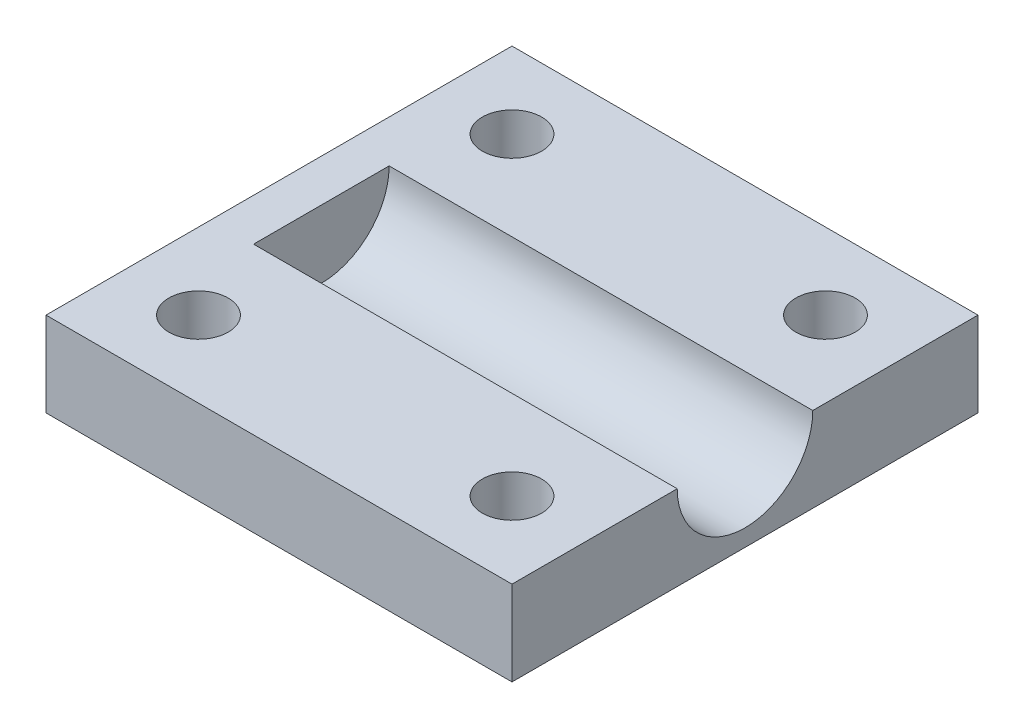
ISO-10303-21;
HEADER;
FILE_DESCRIPTION(('STEP AP214'),'2;1');
FILE_NAME('part.step','',(''),(''),'','','');
FILE_SCHEMA(('AUTOMOTIVE_DESIGN { 1 0 10303 214 1 1 1 1 }'));
ENDSEC;
DATA;
#1=APPLICATION_CONTEXT('core data for automotive mechanical design processes');
#2=APPLICATION_PROTOCOL_DEFINITION('international standard','automotive_design',2000,#1);
#3=PRODUCT_CONTEXT('',#1,'mechanical');
#4=PRODUCT('Part','Part','',(#3));
#5=PRODUCT_RELATED_PRODUCT_CATEGORY('part','',(#4));
#6=PRODUCT_DEFINITION_FORMATION('','',#4);
#7=PRODUCT_DEFINITION_CONTEXT('part definition',#1,'design');
#8=PRODUCT_DEFINITION('design','',#6,#7);
#9=PRODUCT_DEFINITION_SHAPE('','',#8);
#10=(LENGTH_UNIT() NAMED_UNIT(*) SI_UNIT(.MILLI.,.METRE.));
#11=(NAMED_UNIT(*) PLANE_ANGLE_UNIT() SI_UNIT($,.RADIAN.));
#12=(NAMED_UNIT(*) SI_UNIT($,.STERADIAN.) SOLID_ANGLE_UNIT());
#13=UNCERTAINTY_MEASURE_WITH_UNIT(LENGTH_MEASURE(1.E-05),#10,'distance_accuracy_value','');
#14=(GEOMETRIC_REPRESENTATION_CONTEXT(3) GLOBAL_UNCERTAINTY_ASSIGNED_CONTEXT((#13)) GLOBAL_UNIT_ASSIGNED_CONTEXT((#10,
#11,#12)) REPRESENTATION_CONTEXT('',''));
#15=CARTESIAN_POINT('',(0.,0.,0.));
#16=DIRECTION('',(0.,0.,1.));
#17=DIRECTION('',(1.,0.,0.));
#18=AXIS2_PLACEMENT_3D('',#15,#16,#17);
#19=CARTESIAN_POINT('',(27.5,10.,-27.5));
#20=DIRECTION('',(-1.,0.,0.));
#21=DIRECTION('',(0.,0.,1.));
#22=AXIS2_PLACEMENT_3D('',#19,#20,#21);
#23=PLANE('',#22);
#24=DIRECTION('',(0.,0.,-1.));
#25=VECTOR('',#24,1.);
#26=CARTESIAN_POINT('',(27.5,10.,-27.5));
#27=LINE('',#26,#25);
#28=CARTESIAN_POINT('',(27.5,10.,-8.));
#29=VERTEX_POINT('',#28);
#30=CARTESIAN_POINT('',(27.5,10.,-27.5));
#31=VERTEX_POINT('',#30);
#32=EDGE_CURVE('E97',#29,#31,#27,.T.);
#33=ORIENTED_EDGE('',*,*,#32,.F.);
#34=CARTESIAN_POINT('',(27.5,10.,0.));
#35=DIRECTION('',(1.,0.,0.));
#36=DIRECTION('',(0.,0.,-1.));
#37=AXIS2_PLACEMENT_3D('',#34,#35,#36);
#38=CIRCLE('',#37,8.);
#39=CARTESIAN_POINT('',(27.5,10.,8.));
#40=VERTEX_POINT('',#39);
#41=EDGE_CURVE('E107',#40,#29,#38,.T.);
#42=ORIENTED_EDGE('',*,*,#41,.F.);
#43=CARTESIAN_POINT('',(27.5,10.,27.5));
#44=VERTEX_POINT('',#43);
#45=EDGE_CURVE('E121',#44,#40,#27,.T.);
#46=ORIENTED_EDGE('',*,*,#45,.F.);
#47=DIRECTION('',(0.,-1.,0.));
#48=VECTOR('',#47,1.);
#49=CARTESIAN_POINT('',(27.5,10.,27.5));
#50=LINE('',#49,#48);
#51=CARTESIAN_POINT('',(27.5,0.,27.5));
#52=VERTEX_POINT('',#51);
#53=EDGE_CURVE('E132',#44,#52,#50,.T.);
#54=ORIENTED_EDGE('',*,*,#53,.T.);
#55=DIRECTION('',(0.,0.,-1.));
#56=VECTOR('',#55,1.);
#57=CARTESIAN_POINT('',(27.5,0.,-27.5));
#58=LINE('',#57,#56);
#59=CARTESIAN_POINT('',(27.5,0.,-27.5));
#60=VERTEX_POINT('',#59);
#61=EDGE_CURVE('E133',#52,#60,#58,.T.);
#62=ORIENTED_EDGE('',*,*,#61,.T.);
#63=DIRECTION('',(0.,-1.,0.));
#64=VECTOR('',#63,1.);
#65=CARTESIAN_POINT('',(27.5,10.,-27.5));
#66=LINE('',#65,#64);
#67=EDGE_CURVE('E120',#31,#60,#66,.T.);
#68=ORIENTED_EDGE('',*,*,#67,.F.);
#69=EDGE_LOOP('',(#33,#42,#46,#54,#62,#68));
#70=FACE_BOUND('',#69,.T.);
#71=ADVANCED_FACE('F47',(#70),#23,.F.);
#72=CARTESIAN_POINT('',(-27.5,10.,-27.5));
#73=DIRECTION('',(0.,0.,1.));
#74=DIRECTION('',(1.,0.,0.));
#75=AXIS2_PLACEMENT_3D('',#72,#73,#74);
#76=PLANE('',#75);
#77=DIRECTION('',(-1.,0.,0.));
#78=VECTOR('',#77,1.);
#79=CARTESIAN_POINT('',(-27.5,0.,-27.5));
#80=LINE('',#79,#78);
#81=CARTESIAN_POINT('',(-27.5,0.,-27.5));
#82=VERTEX_POINT('',#81);
#83=EDGE_CURVE('E135',#60,#82,#80,.T.);
#84=ORIENTED_EDGE('',*,*,#83,.T.);
#85=DIRECTION('',(0.,-1.,0.));
#86=VECTOR('',#85,1.);
#87=CARTESIAN_POINT('',(-27.5,10.,-27.5));
#88=LINE('',#87,#86);
#89=CARTESIAN_POINT('',(-27.5,10.,-27.5));
#90=VERTEX_POINT('',#89);
#91=EDGE_CURVE('E141',#90,#82,#88,.T.);
#92=ORIENTED_EDGE('',*,*,#91,.F.);
#93=DIRECTION('',(-1.,0.,0.));
#94=VECTOR('',#93,1.);
#95=CARTESIAN_POINT('',(-27.5,10.,-27.5));
#96=LINE('',#95,#94);
#97=EDGE_CURVE('E123',#31,#90,#96,.T.);
#98=ORIENTED_EDGE('',*,*,#97,.F.);
#99=ORIENTED_EDGE('',*,*,#67,.T.);
#100=EDGE_LOOP('',(#84,#92,#98,#99));
#101=FACE_BOUND('',#100,.T.);
#102=ADVANCED_FACE('F146',(#101),#76,.F.);
#103=CARTESIAN_POINT('',(-27.5,10.,-27.5));
#104=DIRECTION('',(1.,0.,0.));
#105=DIRECTION('',(0.,0.,-1.));
#106=AXIS2_PLACEMENT_3D('',#103,#104,#105);
#107=PLANE('',#106);
#108=DIRECTION('',(0.,0.,1.));
#109=VECTOR('',#108,1.);
#110=CARTESIAN_POINT('',(-27.5,0.,-27.5));
#111=LINE('',#110,#109);
#112=CARTESIAN_POINT('',(-27.5,0.,27.5));
#113=VERTEX_POINT('',#112);
#114=EDGE_CURVE('E124',#82,#113,#111,.T.);
#115=ORIENTED_EDGE('',*,*,#114,.T.);
#116=DIRECTION('',(0.,-1.,0.));
#117=VECTOR('',#116,1.);
#118=CARTESIAN_POINT('',(-27.5,10.,27.5));
#119=LINE('',#118,#117);
#120=CARTESIAN_POINT('',(-27.5,10.,27.5));
#121=VERTEX_POINT('',#120);
#122=EDGE_CURVE('E139',#121,#113,#119,.T.);
#123=ORIENTED_EDGE('',*,*,#122,.F.);
#124=DIRECTION('',(0.,0.,1.));
#125=VECTOR('',#124,1.);
#126=CARTESIAN_POINT('',(-27.5,10.,-27.5));
#127=LINE('',#126,#125);
#128=EDGE_CURVE('E129',#90,#121,#127,.T.);
#129=ORIENTED_EDGE('',*,*,#128,.F.);
#130=ORIENTED_EDGE('',*,*,#91,.T.);
#131=EDGE_LOOP('',(#115,#123,#129,#130));
#132=FACE_BOUND('',#131,.T.);
#133=ADVANCED_FACE('F154',(#132),#107,.F.);
#134=CARTESIAN_POINT('',(-27.5,10.,27.5));
#135=DIRECTION('',(0.,0.,-1.));
#136=DIRECTION('',(-1.,0.,0.));
#137=AXIS2_PLACEMENT_3D('',#134,#135,#136);
#138=PLANE('',#137);
#139=DIRECTION('',(1.,0.,0.));
#140=VECTOR('',#139,1.);
#141=CARTESIAN_POINT('',(-27.5,0.,27.5));
#142=LINE('',#141,#140);
#143=EDGE_CURVE('E90',#113,#52,#142,.T.);
#144=ORIENTED_EDGE('',*,*,#143,.T.);
#145=ORIENTED_EDGE('',*,*,#53,.F.);
#146=DIRECTION('',(1.,0.,0.));
#147=VECTOR('',#146,1.);
#148=CARTESIAN_POINT('',(-27.5,10.,27.5));
#149=LINE('',#148,#147);
#150=EDGE_CURVE('E69',#121,#44,#149,.T.);
#151=ORIENTED_EDGE('',*,*,#150,.F.);
#152=ORIENTED_EDGE('',*,*,#122,.T.);
#153=EDGE_LOOP('',(#144,#145,#151,#152));
#154=FACE_BOUND('',#153,.T.);
#155=ADVANCED_FACE('F156',(#154),#138,.F.);
#156=CARTESIAN_POINT('',(0.,10.,0.));
#157=DIRECTION('',(0.,1.,0.));
#158=DIRECTION('',(0.,0.,1.));
#159=AXIS2_PLACEMENT_3D('',#156,#157,#158);
#160=PLANE('',#159);
#161=CARTESIAN_POINT('',(18.5,10.,-18.5));
#162=DIRECTION('',(0.,1.,0.));
#163=DIRECTION('',(0.,0.,1.));
#164=AXIS2_PLACEMENT_3D('',#161,#162,#163);
#165=CIRCLE('',#164,3.5);
#166=CARTESIAN_POINT('',(18.5,10.,-15.));
#167=VERTEX_POINT('',#166);
#168=EDGE_CURVE('E309',#167,#167,#165,.T.);
#169=ORIENTED_EDGE('',*,*,#168,.F.);
#170=EDGE_LOOP('',(#169));
#171=FACE_BOUND('',#170,.T.);
#172=CARTESIAN_POINT('',(-18.5,10.,18.5));
#173=DIRECTION('',(0.,1.,0.));
#174=DIRECTION('',(0.,0.,1.));
#175=AXIS2_PLACEMENT_3D('',#172,#173,#174);
#176=CIRCLE('',#175,3.5);
#177=CARTESIAN_POINT('',(-18.5,10.,22.));
#178=VERTEX_POINT('',#177);
#179=EDGE_CURVE('E310',#178,#178,#176,.T.);
#180=ORIENTED_EDGE('',*,*,#179,.F.);
#181=EDGE_LOOP('',(#180));
#182=FACE_BOUND('',#181,.T.);
#183=CARTESIAN_POINT('',(18.5,10.,18.5));
#184=DIRECTION('',(0.,1.,0.));
#185=DIRECTION('',(0.,0.,1.));
#186=AXIS2_PLACEMENT_3D('',#183,#184,#185);
#187=CIRCLE('',#186,3.5);
#188=CARTESIAN_POINT('',(18.5,10.,22.));
#189=VERTEX_POINT('',#188);
#190=EDGE_CURVE('E322',#189,#189,#187,.T.);
#191=ORIENTED_EDGE('',*,*,#190,.F.);
#192=EDGE_LOOP('',(#191));
#193=FACE_BOUND('',#192,.T.);
#194=CARTESIAN_POINT('',(-18.5,10.,-18.5));
#195=DIRECTION('',(0.,1.,0.));
#196=DIRECTION('',(0.,0.,1.));
#197=AXIS2_PLACEMENT_3D('',#194,#195,#196);
#198=CIRCLE('',#197,3.5);
#199=CARTESIAN_POINT('',(-18.5,10.,-15.));
#200=VERTEX_POINT('',#199);
#201=EDGE_CURVE('E313',#200,#200,#198,.T.);
#202=ORIENTED_EDGE('',*,*,#201,.F.);
#203=EDGE_LOOP('',(#202));
#204=FACE_BOUND('',#203,.T.);
#205=DIRECTION('',(1.,0.,0.));
#206=VECTOR('',#205,1.);
#207=CARTESIAN_POINT('',(-22.5,10.,8.00000000000002));
#208=LINE('',#207,#206);
#209=CARTESIAN_POINT('',(-22.5,10.,8.00000000000002));
#210=VERTEX_POINT('',#209);
#211=EDGE_CURVE('E11',#210,#40,#208,.T.);
#212=ORIENTED_EDGE('',*,*,#211,.F.);
#213=DIRECTION('',(0.,0.,-1.));
#214=VECTOR('',#213,1.);
#215=CARTESIAN_POINT('',(-22.5,10.,0.));
#216=LINE('',#215,#214);
#217=CARTESIAN_POINT('',(-22.5,10.,-7.99999999999998));
#218=VERTEX_POINT('',#217);
#219=EDGE_CURVE('E116',#210,#218,#216,.T.);
#220=ORIENTED_EDGE('',*,*,#219,.T.);
#221=DIRECTION('',(1.,0.,0.));
#222=VECTOR('',#221,1.);
#223=CARTESIAN_POINT('',(-22.5,10.,-7.99999999999998));
#224=LINE('',#223,#222);
#225=EDGE_CURVE('E54',#29,#218,#224,.F.);
#226=ORIENTED_EDGE('',*,*,#225,.F.);
#227=ORIENTED_EDGE('',*,*,#32,.T.);
#228=ORIENTED_EDGE('',*,*,#97,.T.);
#229=ORIENTED_EDGE('',*,*,#128,.T.);
#230=ORIENTED_EDGE('',*,*,#150,.T.);
#231=ORIENTED_EDGE('',*,*,#45,.T.);
#232=EDGE_LOOP('',(#212,#220,#226,#227,#228,#229,#230,#231));
#233=FACE_BOUND('',#232,.T.);
#234=ADVANCED_FACE('F115',(#171,#182,#193,#204,#233),#160,.T.);
#235=CARTESIAN_POINT('',(0.,0.,0.));
#236=DIRECTION('',(0.,1.,0.));
#237=DIRECTION('',(0.,0.,1.));
#238=AXIS2_PLACEMENT_3D('',#235,#236,#237);
#239=PLANE('',#238);
#240=ORIENTED_EDGE('',*,*,#61,.F.);
#241=ORIENTED_EDGE('',*,*,#143,.F.);
#242=ORIENTED_EDGE('',*,*,#114,.F.);
#243=ORIENTED_EDGE('',*,*,#83,.F.);
#244=EDGE_LOOP('',(#240,#241,#242,#243));
#245=FACE_BOUND('',#244,.T.);
#246=ADVANCED_FACE('F150',(#245),#239,.F.);
#247=CARTESIAN_POINT('',(-22.5,10.,0.));
#248=DIRECTION('',(1.,0.,0.));
#249=DIRECTION('',(0.,0.,-1.));
#250=AXIS2_PLACEMENT_3D('',#247,#248,#249);
#251=CYLINDRICAL_SURFACE('',#250,8.);
#252=ORIENTED_EDGE('',*,*,#211,.T.);
#253=ORIENTED_EDGE('',*,*,#41,.T.);
#254=ORIENTED_EDGE('',*,*,#225,.T.);
#255=CARTESIAN_POINT('',(-22.5,10.,0.));
#256=DIRECTION('',(1.,0.,0.));
#257=DIRECTION('',(0.,0.,-1.));
#258=AXIS2_PLACEMENT_3D('',#255,#256,#257);
#259=CIRCLE('',#258,8.);
#260=EDGE_CURVE('E60',#210,#218,#259,.T.);
#261=ORIENTED_EDGE('',*,*,#260,.F.);
#262=EDGE_LOOP('',(#252,#253,#254,#261));
#263=FACE_BOUND('',#262,.T.);
#264=ADVANCED_FACE('F108',(#263),#251,.F.);
#265=CARTESIAN_POINT('',(-22.5,10.,0.));
#266=DIRECTION('',(1.,0.,0.));
#267=DIRECTION('',(0.,0.,-1.));
#268=AXIS2_PLACEMENT_3D('',#265,#266,#267);
#269=PLANE('',#268);
#270=ORIENTED_EDGE('',*,*,#260,.T.);
#271=ORIENTED_EDGE('',*,*,#219,.F.);
#272=EDGE_LOOP('',(#270,#271));
#273=FACE_BOUND('',#272,.T.);
#274=ADVANCED_FACE('F209',(#273),#269,.T.);
#275=CARTESIAN_POINT('',(-18.5,5.,-18.5));
#276=DIRECTION('',(0.,1.,0.));
#277=DIRECTION('',(0.,0.,1.));
#278=AXIS2_PLACEMENT_3D('',#275,#276,#277);
#279=CYLINDRICAL_SURFACE('',#278,3.5);
#280=CARTESIAN_POINT('',(-18.5,5.,-18.5));
#281=DIRECTION('',(0.,1.,0.));
#282=DIRECTION('',(0.,0.,1.));
#283=AXIS2_PLACEMENT_3D('',#280,#281,#282);
#284=CIRCLE('',#283,3.5);
#285=CARTESIAN_POINT('',(-18.5,5.,-15.));
#286=VERTEX_POINT('',#285);
#287=EDGE_CURVE('E113',#286,#286,#284,.T.);
#288=ORIENTED_EDGE('',*,*,#287,.F.);
#289=EDGE_LOOP('',(#288));
#290=FACE_BOUND('',#289,.T.);
#291=ORIENTED_EDGE('',*,*,#201,.T.);
#292=EDGE_LOOP('',(#291));
#293=FACE_BOUND('',#292,.T.);
#294=ADVANCED_FACE('F217',(#290,#293),#279,.F.);
#295=CARTESIAN_POINT('',(-18.5,5.,-18.5));
#296=DIRECTION('',(0.,1.,0.));
#297=DIRECTION('',(0.,0.,1.));
#298=AXIS2_PLACEMENT_3D('',#295,#296,#297);
#299=PLANE('',#298);
#300=ORIENTED_EDGE('',*,*,#287,.T.);
#301=EDGE_LOOP('',(#300));
#302=FACE_BOUND('',#301,.T.);
#303=ADVANCED_FACE('F226',(#302),#299,.T.);
#304=CARTESIAN_POINT('',(18.5,5.,18.5));
#305=DIRECTION('',(0.,1.,0.));
#306=DIRECTION('',(0.,0.,1.));
#307=AXIS2_PLACEMENT_3D('',#304,#305,#306);
#308=CYLINDRICAL_SURFACE('',#307,3.5);
#309=CARTESIAN_POINT('',(18.5,5.,18.5));
#310=DIRECTION('',(0.,1.,0.));
#311=DIRECTION('',(0.,0.,1.));
#312=AXIS2_PLACEMENT_3D('',#309,#310,#311);
#313=CIRCLE('',#312,3.5);
#314=CARTESIAN_POINT('',(18.5,5.,22.));
#315=VERTEX_POINT('',#314);
#316=EDGE_CURVE('E332',#315,#315,#313,.T.);
#317=ORIENTED_EDGE('',*,*,#316,.F.);
#318=EDGE_LOOP('',(#317));
#319=FACE_BOUND('',#318,.T.);
#320=ORIENTED_EDGE('',*,*,#190,.T.);
#321=EDGE_LOOP('',(#320));
#322=FACE_BOUND('',#321,.T.);
#323=ADVANCED_FACE('F237',(#319,#322),#308,.F.);
#324=CARTESIAN_POINT('',(18.5,5.,18.5));
#325=DIRECTION('',(0.,1.,0.));
#326=DIRECTION('',(0.,0.,1.));
#327=AXIS2_PLACEMENT_3D('',#324,#325,#326);
#328=PLANE('',#327);
#329=ORIENTED_EDGE('',*,*,#316,.T.);
#330=EDGE_LOOP('',(#329));
#331=FACE_BOUND('',#330,.T.);
#332=ADVANCED_FACE('F248',(#331),#328,.T.);
#333=CARTESIAN_POINT('',(-18.5,5.,18.5));
#334=DIRECTION('',(0.,1.,0.));
#335=DIRECTION('',(0.,0.,1.));
#336=AXIS2_PLACEMENT_3D('',#333,#334,#335);
#337=CYLINDRICAL_SURFACE('',#336,3.5);
#338=CARTESIAN_POINT('',(-18.5,5.,18.5));
#339=DIRECTION('',(0.,1.,0.));
#340=DIRECTION('',(0.,0.,1.));
#341=AXIS2_PLACEMENT_3D('',#338,#339,#340);
#342=CIRCLE('',#341,3.5);
#343=CARTESIAN_POINT('',(-18.5,5.,22.));
#344=VERTEX_POINT('',#343);
#345=EDGE_CURVE('E316',#344,#344,#342,.T.);
#346=ORIENTED_EDGE('',*,*,#345,.F.);
#347=EDGE_LOOP('',(#346));
#348=FACE_BOUND('',#347,.T.);
#349=ORIENTED_EDGE('',*,*,#179,.T.);
#350=EDGE_LOOP('',(#349));
#351=FACE_BOUND('',#350,.T.);
#352=ADVANCED_FACE('F259',(#348,#351),#337,.F.);
#353=CARTESIAN_POINT('',(-18.5,5.,18.5));
#354=DIRECTION('',(0.,1.,0.));
#355=DIRECTION('',(0.,0.,1.));
#356=AXIS2_PLACEMENT_3D('',#353,#354,#355);
#357=PLANE('',#356);
#358=ORIENTED_EDGE('',*,*,#345,.T.);
#359=EDGE_LOOP('',(#358));
#360=FACE_BOUND('',#359,.T.);
#361=ADVANCED_FACE('F270',(#360),#357,.T.);
#362=CARTESIAN_POINT('',(18.5,5.,-18.5));
#363=DIRECTION('',(0.,1.,0.));
#364=DIRECTION('',(0.,0.,1.));
#365=AXIS2_PLACEMENT_3D('',#362,#363,#364);
#366=CYLINDRICAL_SURFACE('',#365,3.5);
#367=CARTESIAN_POINT('',(18.5,5.,-18.5));
#368=DIRECTION('',(0.,1.,0.));
#369=DIRECTION('',(0.,0.,1.));
#370=AXIS2_PLACEMENT_3D('',#367,#368,#369);
#371=CIRCLE('',#370,3.5);
#372=CARTESIAN_POINT('',(18.5,5.,-15.));
#373=VERTEX_POINT('',#372);
#374=EDGE_CURVE('E308',#373,#373,#371,.T.);
#375=ORIENTED_EDGE('',*,*,#374,.F.);
#376=EDGE_LOOP('',(#375));
#377=FACE_BOUND('',#376,.T.);
#378=ORIENTED_EDGE('',*,*,#168,.T.);
#379=EDGE_LOOP('',(#378));
#380=FACE_BOUND('',#379,.T.);
#381=ADVANCED_FACE('F281',(#377,#380),#366,.F.);
#382=CARTESIAN_POINT('',(18.5,5.,-18.5));
#383=DIRECTION('',(0.,1.,0.));
#384=DIRECTION('',(0.,0.,1.));
#385=AXIS2_PLACEMENT_3D('',#382,#383,#384);
#386=PLANE('',#385);
#387=ORIENTED_EDGE('',*,*,#374,.T.);
#388=EDGE_LOOP('',(#387));
#389=FACE_BOUND('',#388,.T.);
#390=ADVANCED_FACE('F292',(#389),#386,.T.);
#391=CLOSED_SHELL('',(#71,#102,#133,#155,#234,#246,#264,#274,#294,#303,#323,#332,#352,#361,#381,#390));
#392=MANIFOLD_SOLID_BREP('B2',#391);
#393=ADVANCED_BREP_SHAPE_REPRESENTATION('',(#18,#392),#14);
#394=SHAPE_DEFINITION_REPRESENTATION(#9,#393);
ENDSEC;
END-ISO-10303-21;
